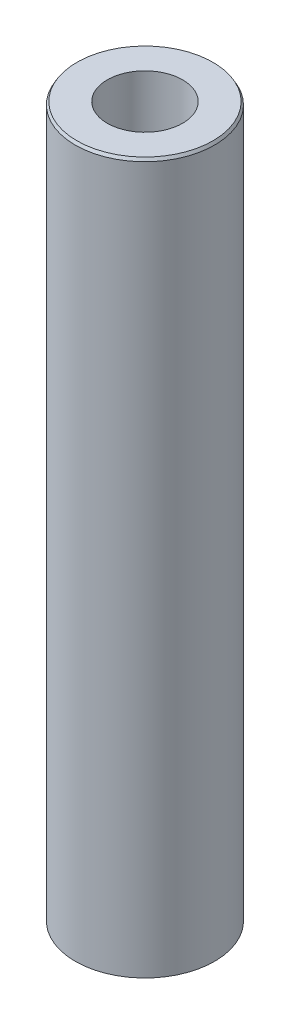
ISO-10303-21;
HEADER;
FILE_DESCRIPTION(('STEP AP214'),'2;1');
FILE_NAME('part.step','',(''),(''),'','','');
FILE_SCHEMA(('AUTOMOTIVE_DESIGN { 1 0 10303 214 1 1 1 1 }'));
ENDSEC;
DATA;
#1=APPLICATION_CONTEXT('core data for automotive mechanical design processes');
#2=APPLICATION_PROTOCOL_DEFINITION('international standard','automotive_design',2000,#1);
#3=PRODUCT_CONTEXT('',#1,'mechanical');
#4=PRODUCT('Part','Part','',(#3));
#5=PRODUCT_RELATED_PRODUCT_CATEGORY('part','',(#4));
#6=PRODUCT_DEFINITION_FORMATION('','',#4);
#7=PRODUCT_DEFINITION_CONTEXT('part definition',#1,'design');
#8=PRODUCT_DEFINITION('design','',#6,#7);
#9=PRODUCT_DEFINITION_SHAPE('','',#8);
#10=(LENGTH_UNIT() NAMED_UNIT(*) SI_UNIT(.MILLI.,.METRE.));
#11=(NAMED_UNIT(*) PLANE_ANGLE_UNIT() SI_UNIT($,.RADIAN.));
#12=(NAMED_UNIT(*) SI_UNIT($,.STERADIAN.) SOLID_ANGLE_UNIT());
#13=UNCERTAINTY_MEASURE_WITH_UNIT(LENGTH_MEASURE(1.E-05),#10,'distance_accuracy_value','');
#14=(GEOMETRIC_REPRESENTATION_CONTEXT(3) GLOBAL_UNCERTAINTY_ASSIGNED_CONTEXT((#13)) GLOBAL_UNIT_ASSIGNED_CONTEXT((#10,
#11,#12)) REPRESENTATION_CONTEXT('',''));
#15=CARTESIAN_POINT('',(0.,0.,0.));
#16=DIRECTION('',(0.,0.,1.));
#17=DIRECTION('',(1.,0.,0.));
#18=AXIS2_PLACEMENT_3D('',#15,#16,#17);
#19=CARTESIAN_POINT('',(0.,433.900877863012,0.));
#20=DIRECTION('',(0.,-1.,0.));
#21=DIRECTION('',(0.,0.,-1.));
#22=AXIS2_PLACEMENT_3D('',#19,#20,#21);
#23=CYLINDRICAL_SURFACE('',#22,42.5);
#24=CARTESIAN_POINT('',(0.,432.143697322259,0.));
#25=DIRECTION('',(0.,1.,0.));
#26=DIRECTION('',(0.,0.,1.));
#27=AXIS2_PLACEMENT_3D('',#24,#25,#26);
#28=CIRCLE('',#27,42.5);
#29=CARTESIAN_POINT('',(0.,432.143697322259,42.5));
#30=VERTEX_POINT('',#29);
#31=EDGE_CURVE('E50',#30,#30,#28,.F.);
#32=ORIENTED_EDGE('',*,*,#31,.T.);
#33=EDGE_LOOP('',(#32));
#34=FACE_BOUND('',#33,.T.);
#35=CARTESIAN_POINT('',(0.,1.01450865821873,0.));
#36=DIRECTION('',(0.,1.,0.));
#37=DIRECTION('',(0.,0.,1.));
#38=AXIS2_PLACEMENT_3D('',#35,#36,#37);
#39=CIRCLE('',#38,42.5);
#40=CARTESIAN_POINT('',(0.,1.01450865821873,42.5));
#41=VERTEX_POINT('',#40);
#42=EDGE_CURVE('E51',#41,#41,#39,.T.);
#43=ORIENTED_EDGE('',*,*,#42,.T.);
#44=EDGE_LOOP('',(#43));
#45=FACE_BOUND('',#44,.T.);
#46=ADVANCED_FACE('F39',(#34,#45),#23,.T.);
#47=CARTESIAN_POINT('',(0.,433.900877863012,0.));
#48=DIRECTION('',(0.,1.,0.));
#49=DIRECTION('',(0.,0.,1.));
#50=AXIS2_PLACEMENT_3D('',#47,#48,#49);
#51=PLANE('',#50);
#52=CARTESIAN_POINT('',(0.,433.900877863012,0.));
#53=DIRECTION('',(0.,1.,0.));
#54=DIRECTION('',(0.,0.,1.));
#55=AXIS2_PLACEMENT_3D('',#52,#53,#54);
#56=CIRCLE('',#55,41.4854913417812);
#57=CARTESIAN_POINT('',(0.,433.900877863012,41.4854913417812));
#58=VERTEX_POINT('',#57);
#59=EDGE_CURVE('E54',#58,#58,#56,.T.);
#60=ORIENTED_EDGE('',*,*,#59,.T.);
#61=EDGE_LOOP('',(#60));
#62=FACE_BOUND('',#61,.T.);
#63=CARTESIAN_POINT('',(0.,433.900877863012,0.));
#64=DIRECTION('',(0.,1.,0.));
#65=DIRECTION('',(0.,0.,1.));
#66=AXIS2_PLACEMENT_3D('',#63,#64,#65);
#67=CIRCLE('',#66,22.9742506825591);
#68=CARTESIAN_POINT('',(0.,433.900877863012,22.9742506825591));
#69=VERTEX_POINT('',#68);
#70=EDGE_CURVE('E58',#69,#69,#67,.T.);
#71=ORIENTED_EDGE('',*,*,#70,.F.);
#72=EDGE_LOOP('',(#71));
#73=FACE_BOUND('',#72,.T.);
#74=ADVANCED_FACE('F69',(#62,#73),#51,.T.);
#75=CARTESIAN_POINT('',(0.,0.,0.));
#76=DIRECTION('',(0.,1.,0.));
#77=DIRECTION('',(0.,0.,1.));
#78=AXIS2_PLACEMENT_3D('',#75,#76,#77);
#79=PLANE('',#78);
#80=CARTESIAN_POINT('',(0.,0.,0.));
#81=DIRECTION('',(0.,1.,0.));
#82=DIRECTION('',(0.,0.,1.));
#83=AXIS2_PLACEMENT_3D('',#80,#81,#82);
#84=CIRCLE('',#83,40.7428194592466);
#85=CARTESIAN_POINT('',(0.,0.,40.7428194592466));
#86=VERTEX_POINT('',#85);
#87=EDGE_CURVE('E10',#86,#86,#84,.F.);
#88=ORIENTED_EDGE('',*,*,#87,.T.);
#89=EDGE_LOOP('',(#88));
#90=FACE_BOUND('',#89,.T.);
#91=CARTESIAN_POINT('',(0.,0.,0.));
#92=DIRECTION('',(0.,1.,0.));
#93=DIRECTION('',(0.,0.,1.));
#94=AXIS2_PLACEMENT_3D('',#91,#92,#93);
#95=CIRCLE('',#94,22.9742506825591);
#96=CARTESIAN_POINT('',(0.,0.,22.9742506825591));
#97=VERTEX_POINT('',#96);
#98=EDGE_CURVE('E63',#97,#97,#95,.T.);
#99=ORIENTED_EDGE('',*,*,#98,.T.);
#100=EDGE_LOOP('',(#99));
#101=FACE_BOUND('',#100,.T.);
#102=ADVANCED_FACE('F75',(#90,#101),#79,.F.);
#103=CARTESIAN_POINT('',(0.,433.900877863012,0.));
#104=DIRECTION('',(0.,-1.,0.));
#105=DIRECTION('',(0.,0.,-1.));
#106=AXIS2_PLACEMENT_3D('',#103,#104,#105);
#107=CYLINDRICAL_SURFACE('',#106,22.9742506825591);
#108=ORIENTED_EDGE('',*,*,#70,.T.);
#109=EDGE_LOOP('',(#108));
#110=FACE_BOUND('',#109,.T.);
#111=ORIENTED_EDGE('',*,*,#98,.F.);
#112=EDGE_LOOP('',(#111));
#113=FACE_BOUND('',#112,.T.);
#114=ADVANCED_FACE('F70',(#110,#113),#107,.F.);
#115=CARTESIAN_POINT('',(0.,433.900877863012,0.));
#116=DIRECTION('',(0.,-1.,0.));
#117=DIRECTION('',(0.,0.,-1.));
#118=AXIS2_PLACEMENT_3D('',#115,#116,#117);
#119=CONICAL_SURFACE('',#118,41.4854913417812,0.523598775598295);
#120=ORIENTED_EDGE('',*,*,#31,.F.);
#121=EDGE_LOOP('',(#120));
#122=FACE_BOUND('',#121,.T.);
#123=ORIENTED_EDGE('',*,*,#59,.F.);
#124=EDGE_LOOP('',(#123));
#125=FACE_BOUND('',#124,.T.);
#126=ADVANCED_FACE('F81',(#122,#125),#119,.T.);
#127=CARTESIAN_POINT('',(0.,1.01450865821873,0.));
#128=DIRECTION('',(0.,1.,0.));
#129=DIRECTION('',(0.,0.,1.));
#130=AXIS2_PLACEMENT_3D('',#127,#128,#129);
#131=CONICAL_SURFACE('',#130,42.5,1.0471975511966);
#132=ORIENTED_EDGE('',*,*,#87,.F.);
#133=EDGE_LOOP('',(#132));
#134=FACE_BOUND('',#133,.T.);
#135=ORIENTED_EDGE('',*,*,#42,.F.);
#136=EDGE_LOOP('',(#135));
#137=FACE_BOUND('',#136,.T.);
#138=ADVANCED_FACE('F45',(#134,#137),#131,.T.);
#139=CLOSED_SHELL('',(#46,#74,#102,#114,#126,#138));
#140=MANIFOLD_SOLID_BREP('B2',#139);
#141=ADVANCED_BREP_SHAPE_REPRESENTATION('',(#18,#140),#14);
#142=SHAPE_DEFINITION_REPRESENTATION(#9,#141);
ENDSEC;
END-ISO-10303-21;
